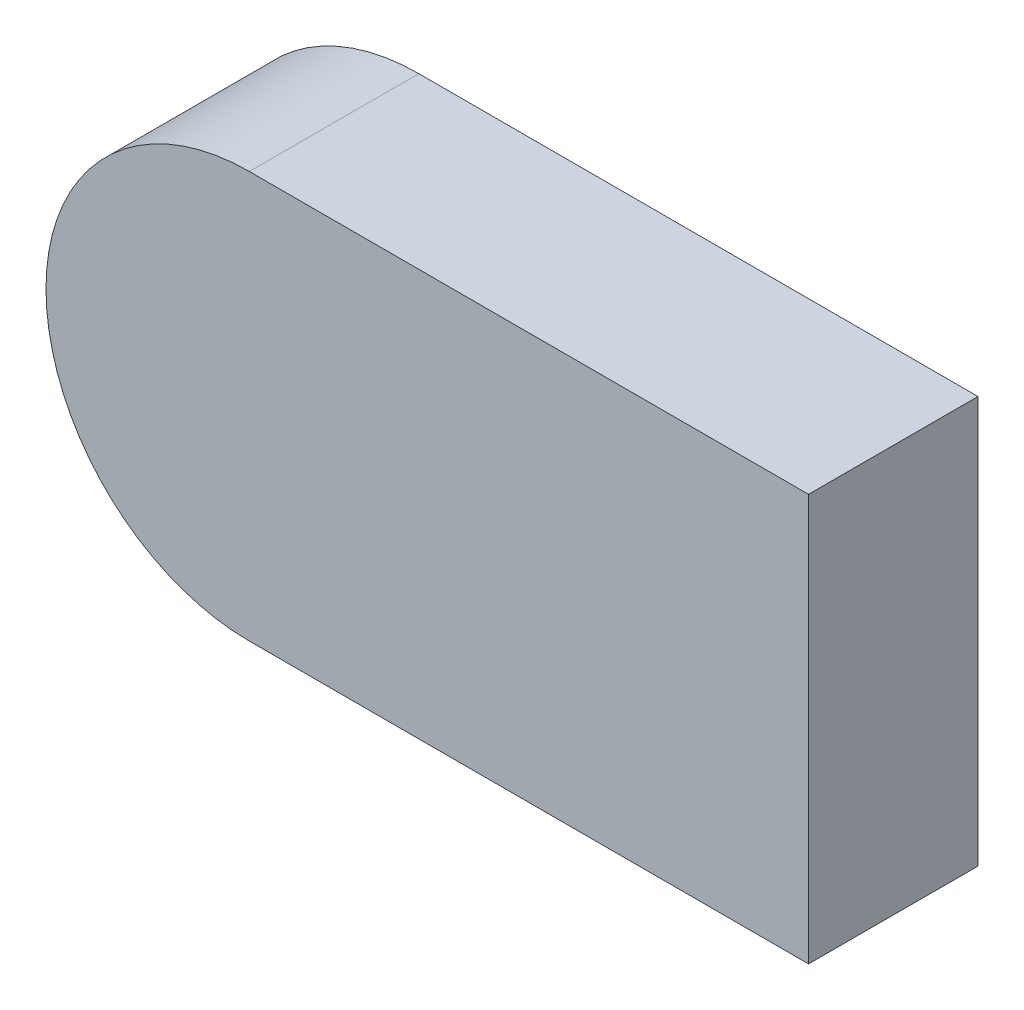
ISO-10303-21;
HEADER;
FILE_DESCRIPTION(('STEP AP214'),'2;1');
FILE_NAME('part.step','',(''),(''),'','','');
FILE_SCHEMA(('AUTOMOTIVE_DESIGN { 1 0 10303 214 1 1 1 1 }'));
ENDSEC;
DATA;
#1=APPLICATION_CONTEXT('core data for automotive mechanical design processes');
#2=APPLICATION_PROTOCOL_DEFINITION('international standard','automotive_design',2000,#1);
#3=PRODUCT_CONTEXT('',#1,'mechanical');
#4=PRODUCT('Part','Part','',(#3));
#5=PRODUCT_RELATED_PRODUCT_CATEGORY('part','',(#4));
#6=PRODUCT_DEFINITION_FORMATION('','',#4);
#7=PRODUCT_DEFINITION_CONTEXT('part definition',#1,'design');
#8=PRODUCT_DEFINITION('design','',#6,#7);
#9=PRODUCT_DEFINITION_SHAPE('','',#8);
#10=(LENGTH_UNIT() NAMED_UNIT(*) SI_UNIT(.MILLI.,.METRE.));
#11=(NAMED_UNIT(*) PLANE_ANGLE_UNIT() SI_UNIT($,.RADIAN.));
#12=(NAMED_UNIT(*) SI_UNIT($,.STERADIAN.) SOLID_ANGLE_UNIT());
#13=UNCERTAINTY_MEASURE_WITH_UNIT(LENGTH_MEASURE(1.E-05),#10,'distance_accuracy_value','');
#14=(GEOMETRIC_REPRESENTATION_CONTEXT(3) GLOBAL_UNCERTAINTY_ASSIGNED_CONTEXT((#13)) GLOBAL_UNIT_ASSIGNED_CONTEXT((#10,
#11,#12)) REPRESENTATION_CONTEXT('',''));
#15=CARTESIAN_POINT('',(0.,0.,0.));
#16=DIRECTION('',(0.,0.,1.));
#17=DIRECTION('',(1.,0.,0.));
#18=AXIS2_PLACEMENT_3D('',#15,#16,#17);
#19=CARTESIAN_POINT('',(4.05,-1.37,0.));
#20=DIRECTION('',(0.,-1.,0.));
#21=DIRECTION('',(-1.,0.,0.));
#22=AXIS2_PLACEMENT_3D('',#19,#20,#21);
#23=PLANE('',#22);
#24=DIRECTION('',(0.,0.,1.));
#25=VECTOR('',#24,1.);
#26=CARTESIAN_POINT('',(4.05,-1.37,0.));
#27=LINE('',#26,#25);
#28=CARTESIAN_POINT('',(4.05,-1.37,0.));
#29=VERTEX_POINT('',#28);
#30=CARTESIAN_POINT('',(4.05,-1.37,0.1));
#31=VERTEX_POINT('',#30);
#32=EDGE_CURVE('E11',#29,#31,#27,.T.);
#33=ORIENTED_EDGE('',*,*,#32,.T.);
#34=DIRECTION('',(-1.,0.,0.));
#35=VECTOR('',#34,1.);
#36=CARTESIAN_POINT('',(4.05,-1.37,0.1));
#37=LINE('',#36,#35);
#38=CARTESIAN_POINT('',(3.72,-1.37,0.1));
#39=VERTEX_POINT('',#38);
#40=EDGE_CURVE('E24',#31,#39,#37,.T.);
#41=ORIENTED_EDGE('',*,*,#40,.T.);
#42=DIRECTION('',(0.,0.,1.));
#43=VECTOR('',#42,1.);
#44=CARTESIAN_POINT('',(3.72,-1.37,0.));
#45=LINE('',#44,#43);
#46=CARTESIAN_POINT('',(3.72,-1.37,0.));
#47=VERTEX_POINT('',#46);
#48=EDGE_CURVE('E86',#47,#39,#45,.T.);
#49=ORIENTED_EDGE('',*,*,#48,.F.);
#50=DIRECTION('',(-1.,0.,0.));
#51=VECTOR('',#50,1.);
#52=CARTESIAN_POINT('',(4.05,-1.37,0.));
#53=LINE('',#52,#51);
#54=EDGE_CURVE('E83',#29,#47,#53,.T.);
#55=ORIENTED_EDGE('',*,*,#54,.F.);
#56=EDGE_LOOP('',(#33,#41,#49,#55));
#57=FACE_BOUND('',#56,.T.);
#58=ADVANCED_FACE('F17',(#57),#23,.T.);
#59=CARTESIAN_POINT('',(3.72,-1.25,0.));
#60=DIRECTION('',(0.,0.,-1.));
#61=DIRECTION('',(1.,0.,0.));
#62=AXIS2_PLACEMENT_3D('',#59,#60,#61);
#63=CYLINDRICAL_SURFACE('',#62,0.12);
#64=CARTESIAN_POINT('',(3.72,-1.25,0.));
#65=DIRECTION('',(0.,0.,1.));
#66=DIRECTION('',(1.,0.,0.));
#67=AXIS2_PLACEMENT_3D('',#64,#65,#66);
#68=CIRCLE('',#67,0.12);
#69=CARTESIAN_POINT('',(3.72,-1.13,0.));
#70=VERTEX_POINT('',#69);
#71=EDGE_CURVE('E80',#70,#47,#68,.T.);
#72=ORIENTED_EDGE('',*,*,#71,.T.);
#73=ORIENTED_EDGE('',*,*,#48,.T.);
#74=CARTESIAN_POINT('',(3.72,-1.25,0.1));
#75=DIRECTION('',(0.,0.,1.));
#76=DIRECTION('',(1.,0.,0.));
#77=AXIS2_PLACEMENT_3D('',#74,#75,#76);
#78=CIRCLE('',#77,0.12);
#79=CARTESIAN_POINT('',(3.72,-1.13,0.1));
#80=VERTEX_POINT('',#79);
#81=EDGE_CURVE('E78',#80,#39,#78,.T.);
#82=ORIENTED_EDGE('',*,*,#81,.F.);
#83=DIRECTION('',(0.,0.,1.));
#84=VECTOR('',#83,1.);
#85=CARTESIAN_POINT('',(3.72,-1.13,0.));
#86=LINE('',#85,#84);
#87=EDGE_CURVE('E67',#70,#80,#86,.T.);
#88=ORIENTED_EDGE('',*,*,#87,.F.);
#89=EDGE_LOOP('',(#72,#73,#82,#88));
#90=FACE_BOUND('',#89,.T.);
#91=ADVANCED_FACE('F89',(#90),#63,.T.);
#92=CARTESIAN_POINT('',(4.05,-1.13,0.));
#93=DIRECTION('',(0.,-1.,0.));
#94=DIRECTION('',(-1.,0.,0.));
#95=AXIS2_PLACEMENT_3D('',#92,#93,#94);
#96=PLANE('',#95);
#97=DIRECTION('',(-1.,0.,0.));
#98=VECTOR('',#97,1.);
#99=CARTESIAN_POINT('',(4.05,-1.13,0.));
#100=LINE('',#99,#98);
#101=CARTESIAN_POINT('',(4.05,-1.13,0.));
#102=VERTEX_POINT('',#101);
#103=EDGE_CURVE('E70',#102,#70,#100,.T.);
#104=ORIENTED_EDGE('',*,*,#103,.T.);
#105=ORIENTED_EDGE('',*,*,#87,.T.);
#106=DIRECTION('',(-1.,0.,0.));
#107=VECTOR('',#106,1.);
#108=CARTESIAN_POINT('',(4.05,-1.13,0.1));
#109=LINE('',#108,#107);
#110=CARTESIAN_POINT('',(4.05,-1.13,0.1));
#111=VERTEX_POINT('',#110);
#112=EDGE_CURVE('E61',#111,#80,#109,.T.);
#113=ORIENTED_EDGE('',*,*,#112,.F.);
#114=DIRECTION('',(0.,0.,1.));
#115=VECTOR('',#114,1.);
#116=CARTESIAN_POINT('',(4.05,-1.13,0.));
#117=LINE('',#116,#115);
#118=EDGE_CURVE('E51',#102,#111,#117,.T.);
#119=ORIENTED_EDGE('',*,*,#118,.F.);
#120=EDGE_LOOP('',(#104,#105,#113,#119));
#121=FACE_BOUND('',#120,.T.);
#122=ADVANCED_FACE('F65',(#121),#96,.F.);
#123=CARTESIAN_POINT('',(4.05,-1.37,0.));
#124=DIRECTION('',(-1.,0.,0.));
#125=DIRECTION('',(0.,1.,0.));
#126=AXIS2_PLACEMENT_3D('',#123,#124,#125);
#127=PLANE('',#126);
#128=DIRECTION('',(0.,1.,0.));
#129=VECTOR('',#128,1.);
#130=CARTESIAN_POINT('',(4.05,-1.37,0.));
#131=LINE('',#130,#129);
#132=EDGE_CURVE('E57',#29,#102,#131,.T.);
#133=ORIENTED_EDGE('',*,*,#132,.T.);
#134=ORIENTED_EDGE('',*,*,#118,.T.);
#135=DIRECTION('',(0.,1.,0.));
#136=VECTOR('',#135,1.);
#137=CARTESIAN_POINT('',(4.05,-1.37,0.1));
#138=LINE('',#137,#136);
#139=EDGE_CURVE('E55',#31,#111,#138,.T.);
#140=ORIENTED_EDGE('',*,*,#139,.F.);
#141=ORIENTED_EDGE('',*,*,#32,.F.);
#142=EDGE_LOOP('',(#133,#134,#140,#141));
#143=FACE_BOUND('',#142,.T.);
#144=ADVANCED_FACE('F53',(#143),#127,.F.);
#145=CARTESIAN_POINT('',(3.849490847913,-1.25,0.));
#146=DIRECTION('',(0.,0.,-1.));
#147=DIRECTION('',(-1.,0.,0.));
#148=AXIS2_PLACEMENT_3D('',#145,#146,#147);
#149=PLANE('',#148);
#150=ORIENTED_EDGE('',*,*,#54,.T.);
#151=ORIENTED_EDGE('',*,*,#71,.F.);
#152=ORIENTED_EDGE('',*,*,#103,.F.);
#153=ORIENTED_EDGE('',*,*,#132,.F.);
#154=EDGE_LOOP('',(#150,#151,#152,#153));
#155=FACE_BOUND('',#154,.T.);
#156=ADVANCED_FACE('F91',(#155),#149,.T.);
#157=CARTESIAN_POINT('',(3.849490847913,-1.25,0.1));
#158=DIRECTION('',(0.,0.,-1.));
#159=DIRECTION('',(-1.,0.,0.));
#160=AXIS2_PLACEMENT_3D('',#157,#158,#159);
#161=PLANE('',#160);
#162=ORIENTED_EDGE('',*,*,#139,.T.);
#163=ORIENTED_EDGE('',*,*,#112,.T.);
#164=ORIENTED_EDGE('',*,*,#81,.T.);
#165=ORIENTED_EDGE('',*,*,#40,.F.);
#166=EDGE_LOOP('',(#162,#163,#164,#165));
#167=FACE_BOUND('',#166,.T.);
#168=ADVANCED_FACE('F72',(#167),#161,.F.);
#169=CLOSED_SHELL('',(#58,#91,#122,#144,#156,#168));
#170=MANIFOLD_SOLID_BREP('B1',#169);
#171=ADVANCED_BREP_SHAPE_REPRESENTATION('',(#18,#170),#14);
#172=SHAPE_DEFINITION_REPRESENTATION(#9,#171);
ENDSEC;
END-ISO-10303-21;
